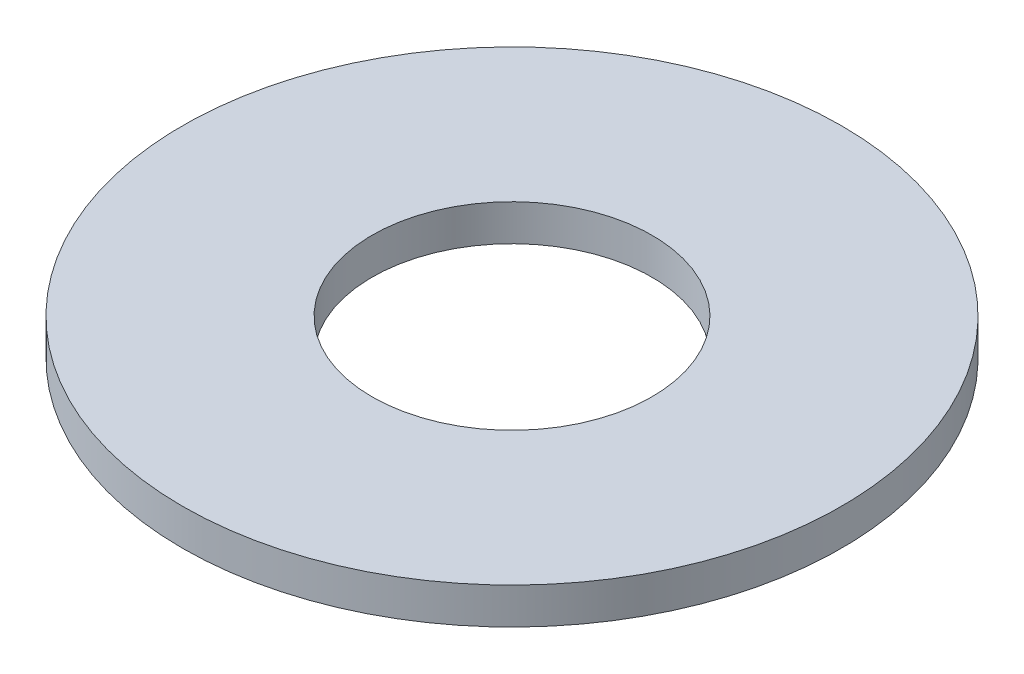
ISO-10303-21;
HEADER;
FILE_DESCRIPTION(('STEP AP214'),'2;1');
FILE_NAME('part.step','',(''),(''),'','','');
FILE_SCHEMA(('AUTOMOTIVE_DESIGN { 1 0 10303 214 1 1 1 1 }'));
ENDSEC;
DATA;
#1=APPLICATION_CONTEXT('core data for automotive mechanical design processes');
#2=APPLICATION_PROTOCOL_DEFINITION('international standard','automotive_design',2000,#1);
#3=PRODUCT_CONTEXT('',#1,'mechanical');
#4=PRODUCT('Part','Part','',(#3));
#5=PRODUCT_RELATED_PRODUCT_CATEGORY('part','',(#4));
#6=PRODUCT_DEFINITION_FORMATION('','',#4);
#7=PRODUCT_DEFINITION_CONTEXT('part definition',#1,'design');
#8=PRODUCT_DEFINITION('design','',#6,#7);
#9=PRODUCT_DEFINITION_SHAPE('','',#8);
#10=(LENGTH_UNIT() NAMED_UNIT(*) SI_UNIT(.MILLI.,.METRE.));
#11=(NAMED_UNIT(*) PLANE_ANGLE_UNIT() SI_UNIT($,.RADIAN.));
#12=(NAMED_UNIT(*) SI_UNIT($,.STERADIAN.) SOLID_ANGLE_UNIT());
#13=UNCERTAINTY_MEASURE_WITH_UNIT(LENGTH_MEASURE(1.E-05),#10,'distance_accuracy_value','');
#14=(GEOMETRIC_REPRESENTATION_CONTEXT(3) GLOBAL_UNCERTAINTY_ASSIGNED_CONTEXT((#13)) GLOBAL_UNIT_ASSIGNED_CONTEXT((#10,
#11,#12)) REPRESENTATION_CONTEXT('',''));
#15=CARTESIAN_POINT('',(0.,0.,0.));
#16=DIRECTION('',(0.,0.,1.));
#17=DIRECTION('',(1.,0.,0.));
#18=AXIS2_PLACEMENT_3D('',#15,#16,#17);
#19=CARTESIAN_POINT('',(0.,1.7526,0.));
#20=DIRECTION('',(0.,1.,0.));
#21=DIRECTION('',(0.,0.,1.));
#22=AXIS2_PLACEMENT_3D('',#19,#20,#21);
#23=PLANE('',#22);
#24=CARTESIAN_POINT('',(0.,1.7526,0.));
#25=DIRECTION('',(0.,1.,0.));
#26=DIRECTION('',(0.,0.,1.));
#27=AXIS2_PLACEMENT_3D('',#24,#25,#26);
#28=CIRCLE('',#27,6.7437);
#29=CARTESIAN_POINT('',(0.,1.7526,6.7437));
#30=VERTEX_POINT('',#29);
#31=EDGE_CURVE('E27',#30,#30,#28,.F.);
#32=ORIENTED_EDGE('',*,*,#31,.T.);
#33=EDGE_LOOP('',(#32));
#34=FACE_BOUND('',#33,.T.);
#35=CARTESIAN_POINT('',(0.,1.7526,0.));
#36=DIRECTION('',(0.,-1.,0.));
#37=DIRECTION('',(0.,0.,-1.));
#38=AXIS2_PLACEMENT_3D('',#35,#36,#37);
#39=CIRCLE('',#38,15.875);
#40=CARTESIAN_POINT('',(0.,1.7526,-15.875));
#41=VERTEX_POINT('',#40);
#42=EDGE_CURVE('E18',#41,#41,#39,.T.);
#43=ORIENTED_EDGE('',*,*,#42,.F.);
#44=EDGE_LOOP('',(#43));
#45=FACE_BOUND('',#44,.T.);
#46=ADVANCED_FACE('F15',(#34,#45),#23,.T.);
#47=CARTESIAN_POINT('',(0.,1.7526,0.));
#48=DIRECTION('',(0.,-1.,0.));
#49=DIRECTION('',(0.,0.,-1.));
#50=AXIS2_PLACEMENT_3D('',#47,#48,#49);
#51=CYLINDRICAL_SURFACE('',#50,15.875);
#52=CARTESIAN_POINT('',(0.,0.,0.));
#53=DIRECTION('',(0.,-1.,0.));
#54=DIRECTION('',(0.,0.,-1.));
#55=AXIS2_PLACEMENT_3D('',#52,#53,#54);
#56=CIRCLE('',#55,15.875);
#57=CARTESIAN_POINT('',(0.,0.,-15.875));
#58=VERTEX_POINT('',#57);
#59=EDGE_CURVE('E22',#58,#58,#56,.F.);
#60=ORIENTED_EDGE('',*,*,#59,.T.);
#61=EDGE_LOOP('',(#60));
#62=FACE_BOUND('',#61,.T.);
#63=ORIENTED_EDGE('',*,*,#42,.T.);
#64=EDGE_LOOP('',(#63));
#65=FACE_BOUND('',#64,.T.);
#66=ADVANCED_FACE('F35',(#62,#65),#51,.T.);
#67=CARTESIAN_POINT('',(0.,0.,0.));
#68=DIRECTION('',(0.,1.,0.));
#69=DIRECTION('',(0.,0.,1.));
#70=AXIS2_PLACEMENT_3D('',#67,#68,#69);
#71=CYLINDRICAL_SURFACE('',#70,6.7437);
#72=ORIENTED_EDGE('',*,*,#31,.F.);
#73=EDGE_LOOP('',(#72));
#74=FACE_BOUND('',#73,.T.);
#75=CARTESIAN_POINT('',(0.,0.,0.));
#76=DIRECTION('',(0.,1.,0.));
#77=DIRECTION('',(0.,0.,1.));
#78=AXIS2_PLACEMENT_3D('',#75,#76,#77);
#79=CIRCLE('',#78,6.7437);
#80=CARTESIAN_POINT('',(0.,0.,6.7437));
#81=VERTEX_POINT('',#80);
#82=EDGE_CURVE('E10',#81,#81,#79,.F.);
#83=ORIENTED_EDGE('',*,*,#82,.T.);
#84=EDGE_LOOP('',(#83));
#85=FACE_BOUND('',#84,.T.);
#86=ADVANCED_FACE('F42',(#74,#85),#71,.F.);
#87=CARTESIAN_POINT('',(0.,0.,0.));
#88=DIRECTION('',(0.,1.,0.));
#89=DIRECTION('',(0.,0.,1.));
#90=AXIS2_PLACEMENT_3D('',#87,#88,#89);
#91=PLANE('',#90);
#92=ORIENTED_EDGE('',*,*,#82,.F.);
#93=EDGE_LOOP('',(#92));
#94=FACE_BOUND('',#93,.T.);
#95=ORIENTED_EDGE('',*,*,#59,.F.);
#96=EDGE_LOOP('',(#95));
#97=FACE_BOUND('',#96,.T.);
#98=ADVANCED_FACE('F44',(#94,#97),#91,.F.);
#99=CLOSED_SHELL('',(#46,#66,#86,#98));
#100=MANIFOLD_SOLID_BREP('B1',#99);
#101=ADVANCED_BREP_SHAPE_REPRESENTATION('',(#18,#100),#14);
#102=SHAPE_DEFINITION_REPRESENTATION(#9,#101);
ENDSEC;
END-ISO-10303-21;
